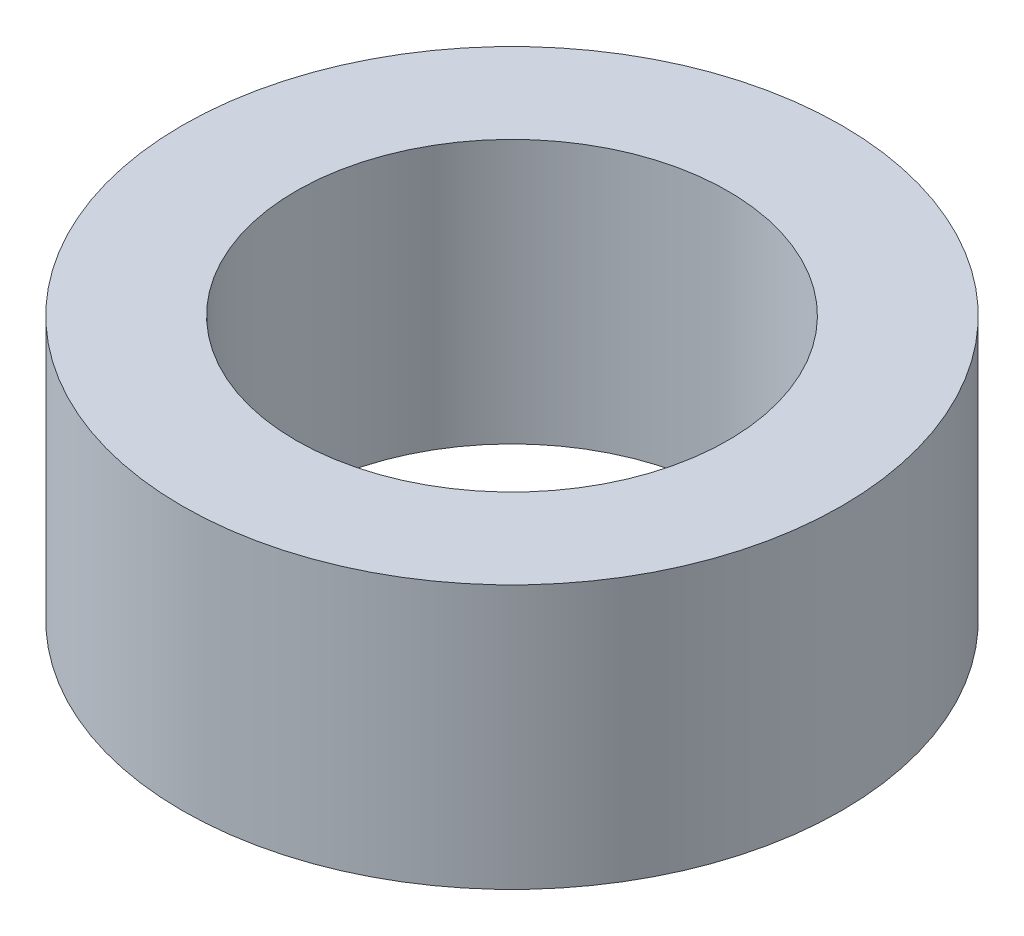
ISO-10303-21;
HEADER;
FILE_DESCRIPTION(('STEP AP214'),'2;1');
FILE_NAME('part.step','',(''),(''),'','','');
FILE_SCHEMA(('AUTOMOTIVE_DESIGN { 1 0 10303 214 1 1 1 1 }'));
ENDSEC;
DATA;
#1=APPLICATION_CONTEXT('core data for automotive mechanical design processes');
#2=APPLICATION_PROTOCOL_DEFINITION('international standard','automotive_design',2000,#1);
#3=PRODUCT_CONTEXT('',#1,'mechanical');
#4=PRODUCT('Part','Part','',(#3));
#5=PRODUCT_RELATED_PRODUCT_CATEGORY('part','',(#4));
#6=PRODUCT_DEFINITION_FORMATION('','',#4);
#7=PRODUCT_DEFINITION_CONTEXT('part definition',#1,'design');
#8=PRODUCT_DEFINITION('design','',#6,#7);
#9=PRODUCT_DEFINITION_SHAPE('','',#8);
#10=(LENGTH_UNIT() NAMED_UNIT(*) SI_UNIT(.MILLI.,.METRE.));
#11=(NAMED_UNIT(*) PLANE_ANGLE_UNIT() SI_UNIT($,.RADIAN.));
#12=(NAMED_UNIT(*) SI_UNIT($,.STERADIAN.) SOLID_ANGLE_UNIT());
#13=UNCERTAINTY_MEASURE_WITH_UNIT(LENGTH_MEASURE(1.E-05),#10,'distance_accuracy_value','');
#14=(GEOMETRIC_REPRESENTATION_CONTEXT(3) GLOBAL_UNCERTAINTY_ASSIGNED_CONTEXT((#13)) GLOBAL_UNIT_ASSIGNED_CONTEXT((#10,
#11,#12)) REPRESENTATION_CONTEXT('',''));
#15=CARTESIAN_POINT('',(0.,0.,0.));
#16=DIRECTION('',(0.,0.,1.));
#17=DIRECTION('',(1.,0.,0.));
#18=AXIS2_PLACEMENT_3D('',#15,#16,#17);
#19=CARTESIAN_POINT('',(0.,3.175,0.));
#20=DIRECTION('',(0.,1.,0.));
#21=DIRECTION('',(0.,0.,1.));
#22=AXIS2_PLACEMENT_3D('',#19,#20,#21);
#23=PLANE('',#22);
#24=CARTESIAN_POINT('',(0.,3.175,0.));
#25=DIRECTION('',(0.,1.,0.));
#26=DIRECTION('',(0.,0.,1.));
#27=AXIS2_PLACEMENT_3D('',#24,#25,#26);
#28=CIRCLE('',#27,3.96875);
#29=CARTESIAN_POINT('',(0.,3.175,3.96875));
#30=VERTEX_POINT('',#29);
#31=EDGE_CURVE('E10',#30,#30,#28,.T.);
#32=ORIENTED_EDGE('',*,*,#31,.T.);
#33=EDGE_LOOP('',(#32));
#34=FACE_BOUND('',#33,.T.);
#35=CARTESIAN_POINT('',(0.,3.175,0.));
#36=DIRECTION('',(0.,1.,0.));
#37=DIRECTION('',(0.,0.,1.));
#38=AXIS2_PLACEMENT_3D('',#35,#36,#37);
#39=CIRCLE('',#38,2.6);
#40=CARTESIAN_POINT('',(0.,3.175,2.6));
#41=VERTEX_POINT('',#40);
#42=EDGE_CURVE('E43',#41,#41,#39,.T.);
#43=ORIENTED_EDGE('',*,*,#42,.F.);
#44=EDGE_LOOP('',(#43));
#45=FACE_BOUND('',#44,.T.);
#46=ADVANCED_FACE('F32',(#34,#45),#23,.T.);
#47=CARTESIAN_POINT('',(0.,0.,0.));
#48=DIRECTION('',(0.,1.,0.));
#49=DIRECTION('',(0.,0.,1.));
#50=AXIS2_PLACEMENT_3D('',#47,#48,#49);
#51=PLANE('',#50);
#52=CARTESIAN_POINT('',(0.,0.,0.));
#53=DIRECTION('',(0.,1.,0.));
#54=DIRECTION('',(0.,0.,1.));
#55=AXIS2_PLACEMENT_3D('',#52,#53,#54);
#56=CIRCLE('',#55,3.96875);
#57=CARTESIAN_POINT('',(0.,0.,3.96875));
#58=VERTEX_POINT('',#57);
#59=EDGE_CURVE('E36',#58,#58,#56,.T.);
#60=ORIENTED_EDGE('',*,*,#59,.F.);
#61=EDGE_LOOP('',(#60));
#62=FACE_BOUND('',#61,.T.);
#63=CARTESIAN_POINT('',(0.,0.,0.));
#64=DIRECTION('',(0.,1.,0.));
#65=DIRECTION('',(0.,0.,1.));
#66=AXIS2_PLACEMENT_3D('',#63,#64,#65);
#67=CIRCLE('',#66,2.6);
#68=CARTESIAN_POINT('',(0.,0.,2.6));
#69=VERTEX_POINT('',#68);
#70=EDGE_CURVE('E45',#69,#69,#67,.T.);
#71=ORIENTED_EDGE('',*,*,#70,.T.);
#72=EDGE_LOOP('',(#71));
#73=FACE_BOUND('',#72,.T.);
#74=ADVANCED_FACE('F55',(#62,#73),#51,.F.);
#75=CARTESIAN_POINT('',(0.,3.175,0.));
#76=DIRECTION('',(0.,-1.,0.));
#77=DIRECTION('',(0.,0.,-1.));
#78=AXIS2_PLACEMENT_3D('',#75,#76,#77);
#79=CYLINDRICAL_SURFACE('',#78,3.96875);
#80=ORIENTED_EDGE('',*,*,#31,.F.);
#81=EDGE_LOOP('',(#80));
#82=FACE_BOUND('',#81,.T.);
#83=ORIENTED_EDGE('',*,*,#59,.T.);
#84=EDGE_LOOP('',(#83));
#85=FACE_BOUND('',#84,.T.);
#86=ADVANCED_FACE('F34',(#82,#85),#79,.T.);
#87=CARTESIAN_POINT('',(0.,3.175,0.));
#88=DIRECTION('',(0.,-1.,0.));
#89=DIRECTION('',(0.,0.,-1.));
#90=AXIS2_PLACEMENT_3D('',#87,#88,#89);
#91=CYLINDRICAL_SURFACE('',#90,2.6);
#92=ORIENTED_EDGE('',*,*,#42,.T.);
#93=EDGE_LOOP('',(#92));
#94=FACE_BOUND('',#93,.T.);
#95=ORIENTED_EDGE('',*,*,#70,.F.);
#96=EDGE_LOOP('',(#95));
#97=FACE_BOUND('',#96,.T.);
#98=ADVANCED_FACE('F51',(#94,#97),#91,.F.);
#99=CLOSED_SHELL('',(#46,#74,#86,#98));
#100=MANIFOLD_SOLID_BREP('B2',#99);
#101=ADVANCED_BREP_SHAPE_REPRESENTATION('',(#18,#100),#14);
#102=SHAPE_DEFINITION_REPRESENTATION(#9,#101);
ENDSEC;
END-ISO-10303-21;
